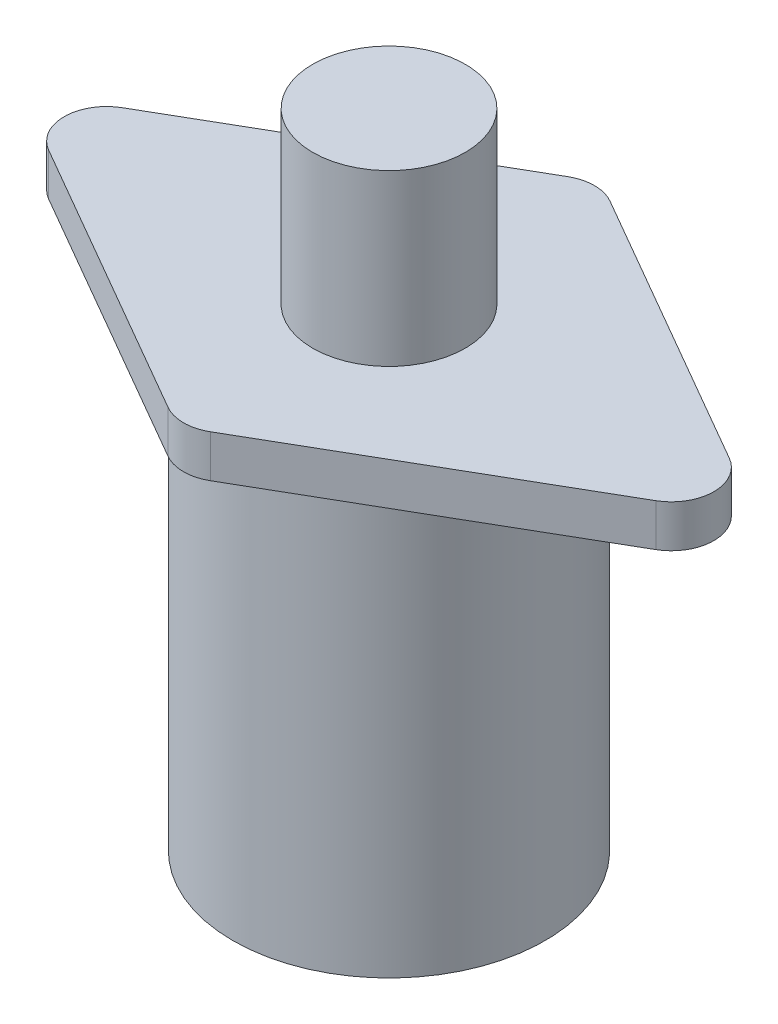
ISO-10303-21;
HEADER;
FILE_DESCRIPTION(('STEP AP214'),'2;1');
FILE_NAME('part.step','',(''),(''),'','','');
FILE_SCHEMA(('AUTOMOTIVE_DESIGN { 1 0 10303 214 1 1 1 1 }'));
ENDSEC;
DATA;
#1=APPLICATION_CONTEXT('core data for automotive mechanical design processes');
#2=APPLICATION_PROTOCOL_DEFINITION('international standard','automotive_design',2000,#1);
#3=PRODUCT_CONTEXT('',#1,'mechanical');
#4=PRODUCT('Part','Part','',(#3));
#5=PRODUCT_RELATED_PRODUCT_CATEGORY('part','',(#4));
#6=PRODUCT_DEFINITION_FORMATION('','',#4);
#7=PRODUCT_DEFINITION_CONTEXT('part definition',#1,'design');
#8=PRODUCT_DEFINITION('design','',#6,#7);
#9=PRODUCT_DEFINITION_SHAPE('','',#8);
#10=(LENGTH_UNIT() NAMED_UNIT(*) SI_UNIT(.MILLI.,.METRE.));
#11=(NAMED_UNIT(*) PLANE_ANGLE_UNIT() SI_UNIT($,.RADIAN.));
#12=(NAMED_UNIT(*) SI_UNIT($,.STERADIAN.) SOLID_ANGLE_UNIT());
#13=UNCERTAINTY_MEASURE_WITH_UNIT(LENGTH_MEASURE(1.E-05),#10,'distance_accuracy_value','');
#14=(GEOMETRIC_REPRESENTATION_CONTEXT(3) GLOBAL_UNCERTAINTY_ASSIGNED_CONTEXT((#13)) GLOBAL_UNIT_ASSIGNED_CONTEXT((#10,
#11,#12)) REPRESENTATION_CONTEXT('',''));
#15=CARTESIAN_POINT('',(0.,0.,0.));
#16=DIRECTION('',(0.,0.,1.));
#17=DIRECTION('',(1.,0.,0.));
#18=AXIS2_PLACEMENT_3D('',#15,#16,#17);
#19=CARTESIAN_POINT('',(0.,50.8,0.));
#20=DIRECTION('',(0.,-1.,0.));
#21=DIRECTION('',(0.,0.,-1.));
#22=AXIS2_PLACEMENT_3D('',#19,#20,#21);
#23=CYLINDRICAL_SURFACE('',#22,18.4);
#24=CARTESIAN_POINT('',(0.,50.8,0.));
#25=DIRECTION('',(0.,1.,0.));
#26=DIRECTION('',(0.,0.,1.));
#27=AXIS2_PLACEMENT_3D('',#24,#25,#26);
#28=CIRCLE('',#27,18.4);
#29=CARTESIAN_POINT('',(0.,50.8,18.4));
#30=VERTEX_POINT('',#29);
#31=EDGE_CURVE('E149',#30,#30,#28,.T.);
#32=ORIENTED_EDGE('',*,*,#31,.F.);
#33=EDGE_LOOP('',(#32));
#34=FACE_BOUND('',#33,.T.);
#35=CARTESIAN_POINT('',(0.,0.,0.));
#36=DIRECTION('',(0.,1.,0.));
#37=DIRECTION('',(0.,0.,1.));
#38=AXIS2_PLACEMENT_3D('',#35,#36,#37);
#39=CIRCLE('',#38,18.4);
#40=CARTESIAN_POINT('',(0.,0.,18.4));
#41=VERTEX_POINT('',#40);
#42=EDGE_CURVE('E152',#41,#41,#39,.T.);
#43=ORIENTED_EDGE('',*,*,#42,.T.);
#44=EDGE_LOOP('',(#43));
#45=FACE_BOUND('',#44,.T.);
#46=ADVANCED_FACE('F43',(#34,#45),#23,.T.);
#47=CARTESIAN_POINT('',(0.,0.,0.));
#48=DIRECTION('',(0.,1.,0.));
#49=DIRECTION('',(0.,0.,1.));
#50=AXIS2_PLACEMENT_3D('',#47,#48,#49);
#51=PLANE('',#50);
#52=ORIENTED_EDGE('',*,*,#42,.F.);
#53=EDGE_LOOP('',(#52));
#54=FACE_BOUND('',#53,.T.);
#55=ADVANCED_FACE('F222',(#54),#51,.F.);
#56=CARTESIAN_POINT('',(43.3012701892219,55.8,0.));
#57=DIRECTION('',(-0.5,0.,0.866025403784439));
#58=DIRECTION('',(0.866025403784439,0.,0.5));
#59=AXIS2_PLACEMENT_3D('',#56,#57,#58);
#60=PLANE('',#59);
#61=DIRECTION('',(-0.866025403784438,0.,-0.5));
#62=VECTOR('',#61,1.);
#63=CARTESIAN_POINT('',(43.3012701892219,50.8,0.));
#64=LINE('',#63,#62);
#65=CARTESIAN_POINT('',(35.8012701892219,50.8,-4.3301270189222));
#66=VERTEX_POINT('',#65);
#67=CARTESIAN_POINT('',(2.50000000000002,50.8,-23.5566243270259));
#68=VERTEX_POINT('',#67);
#69=EDGE_CURVE('E138',#66,#68,#64,.T.);
#70=ORIENTED_EDGE('',*,*,#69,.T.);
#71=DIRECTION('',(0.,-1.,0.));
#72=VECTOR('',#71,1.);
#73=CARTESIAN_POINT('',(2.50000000000002,55.8,-23.5566243270259));
#74=LINE('',#73,#72);
#75=CARTESIAN_POINT('',(2.50000000000002,55.8,-23.5566243270259));
#76=VERTEX_POINT('',#75);
#77=EDGE_CURVE('E116',#68,#76,#74,.F.);
#78=ORIENTED_EDGE('',*,*,#77,.T.);
#79=DIRECTION('',(-0.866025403784438,0.,-0.5));
#80=VECTOR('',#79,1.);
#81=CARTESIAN_POINT('',(43.3012701892219,55.8,0.));
#82=LINE('',#81,#80);
#83=CARTESIAN_POINT('',(35.8012701892219,55.8,-4.3301270189222));
#84=VERTEX_POINT('',#83);
#85=EDGE_CURVE('E148',#84,#76,#82,.T.);
#86=ORIENTED_EDGE('',*,*,#85,.F.);
#87=DIRECTION('',(0.,-1.,0.));
#88=VECTOR('',#87,1.);
#89=CARTESIAN_POINT('',(35.8012701892219,55.8,-4.3301270189222));
#90=LINE('',#89,#88);
#91=EDGE_CURVE('E121',#84,#66,#90,.T.);
#92=ORIENTED_EDGE('',*,*,#91,.T.);
#93=EDGE_LOOP('',(#70,#78,#86,#92));
#94=FACE_BOUND('',#93,.T.);
#95=ADVANCED_FACE('F197',(#94),#60,.F.);
#96=CARTESIAN_POINT('',(0.,55.8,-25.));
#97=DIRECTION('',(0.5,0.,0.866025403784439));
#98=DIRECTION('',(0.866025403784439,0.,-0.5));
#99=AXIS2_PLACEMENT_3D('',#96,#97,#98);
#100=PLANE('',#99);
#101=DIRECTION('',(-0.866025403784439,0.,0.5));
#102=VECTOR('',#101,1.);
#103=CARTESIAN_POINT('',(0.,55.8,-25.));
#104=LINE('',#103,#102);
#105=CARTESIAN_POINT('',(-2.49999999999999,55.8,-23.5566243270259));
#106=VERTEX_POINT('',#105);
#107=CARTESIAN_POINT('',(-35.8012701892219,55.8,-4.33012701892221));
#108=VERTEX_POINT('',#107);
#109=EDGE_CURVE('E131',#106,#108,#104,.T.);
#110=ORIENTED_EDGE('',*,*,#109,.F.);
#111=DIRECTION('',(0.,-1.,0.));
#112=VECTOR('',#111,1.);
#113=CARTESIAN_POINT('',(-2.49999999999999,55.8,-23.5566243270259));
#114=LINE('',#113,#112);
#115=CARTESIAN_POINT('',(-2.49999999999999,50.8,-23.5566243270259));
#116=VERTEX_POINT('',#115);
#117=EDGE_CURVE('E115',#106,#116,#114,.T.);
#118=ORIENTED_EDGE('',*,*,#117,.T.);
#119=DIRECTION('',(-0.866025403784439,0.,0.5));
#120=VECTOR('',#119,1.);
#121=CARTESIAN_POINT('',(0.,50.8,-25.));
#122=LINE('',#121,#120);
#123=CARTESIAN_POINT('',(-35.8012701892219,50.8,-4.33012701892221));
#124=VERTEX_POINT('',#123);
#125=EDGE_CURVE('E128',#116,#124,#122,.T.);
#126=ORIENTED_EDGE('',*,*,#125,.T.);
#127=DIRECTION('',(0.,-1.,0.));
#128=VECTOR('',#127,1.);
#129=CARTESIAN_POINT('',(-35.8012701892219,55.8,-4.3301270189222));
#130=LINE('',#129,#128);
#131=EDGE_CURVE('E133',#124,#108,#130,.F.);
#132=ORIENTED_EDGE('',*,*,#131,.T.);
#133=EDGE_LOOP('',(#110,#118,#126,#132));
#134=FACE_BOUND('',#133,.T.);
#135=ADVANCED_FACE('F127',(#134),#100,.F.);
#136=CARTESIAN_POINT('',(-43.3012701892219,55.8,0.));
#137=DIRECTION('',(0.5,0.,-0.866025403784439));
#138=DIRECTION('',(-0.866025403784439,0.,-0.5));
#139=AXIS2_PLACEMENT_3D('',#136,#137,#138);
#140=PLANE('',#139);
#141=DIRECTION('',(0.866025403784439,0.,0.5));
#142=VECTOR('',#141,1.);
#143=CARTESIAN_POINT('',(-43.3012701892219,50.8,0.));
#144=LINE('',#143,#142);
#145=CARTESIAN_POINT('',(-35.8012701892219,50.8,4.33012701892218));
#146=VERTEX_POINT('',#145);
#147=CARTESIAN_POINT('',(-2.5,50.8,23.5566243270259));
#148=VERTEX_POINT('',#147);
#149=EDGE_CURVE('E137',#146,#148,#144,.T.);
#150=ORIENTED_EDGE('',*,*,#149,.T.);
#151=DIRECTION('',(0.,-1.,0.));
#152=VECTOR('',#151,1.);
#153=CARTESIAN_POINT('',(-2.5,55.8,23.5566243270259));
#154=LINE('',#153,#152);
#155=CARTESIAN_POINT('',(-2.5,55.8,23.5566243270259));
#156=VERTEX_POINT('',#155);
#157=EDGE_CURVE('E47',#148,#156,#154,.F.);
#158=ORIENTED_EDGE('',*,*,#157,.T.);
#159=DIRECTION('',(0.866025403784439,0.,0.5));
#160=VECTOR('',#159,1.);
#161=CARTESIAN_POINT('',(-43.3012701892219,55.8,0.));
#162=LINE('',#161,#160);
#163=CARTESIAN_POINT('',(-35.8012701892219,55.8,4.33012701892218));
#164=VERTEX_POINT('',#163);
#165=EDGE_CURVE('E181',#164,#156,#162,.T.);
#166=ORIENTED_EDGE('',*,*,#165,.F.);
#167=DIRECTION('',(0.,-1.,0.));
#168=VECTOR('',#167,1.);
#169=CARTESIAN_POINT('',(-35.8012701892219,55.8,4.33012701892218));
#170=LINE('',#169,#168);
#171=EDGE_CURVE('E174',#164,#146,#170,.T.);
#172=ORIENTED_EDGE('',*,*,#171,.T.);
#173=EDGE_LOOP('',(#150,#158,#166,#172));
#174=FACE_BOUND('',#173,.T.);
#175=ADVANCED_FACE('F180',(#174),#140,.F.);
#176=CARTESIAN_POINT('',(0.,55.8,25.));
#177=DIRECTION('',(-0.5,0.,-0.866025403784439));
#178=DIRECTION('',(-0.866025403784439,0.,0.5));
#179=AXIS2_PLACEMENT_3D('',#176,#177,#178);
#180=PLANE('',#179);
#181=DIRECTION('',(0.866025403784439,0.,-0.5));
#182=VECTOR('',#181,1.);
#183=CARTESIAN_POINT('',(0.,55.8,25.));
#184=LINE('',#183,#182);
#185=CARTESIAN_POINT('',(2.50000000000001,55.8,23.5566243270259));
#186=VERTEX_POINT('',#185);
#187=CARTESIAN_POINT('',(35.8012701892219,55.8,4.33012701892219));
#188=VERTEX_POINT('',#187);
#189=EDGE_CURVE('E155',#186,#188,#184,.T.);
#190=ORIENTED_EDGE('',*,*,#189,.F.);
#191=DIRECTION('',(0.,-1.,0.));
#192=VECTOR('',#191,1.);
#193=CARTESIAN_POINT('',(2.50000000000001,55.8,23.5566243270259));
#194=LINE('',#193,#192);
#195=CARTESIAN_POINT('',(2.50000000000001,50.8,23.5566243270259));
#196=VERTEX_POINT('',#195);
#197=EDGE_CURVE('E172',#186,#196,#194,.T.);
#198=ORIENTED_EDGE('',*,*,#197,.T.);
#199=DIRECTION('',(0.866025403784439,0.,-0.5));
#200=VECTOR('',#199,1.);
#201=CARTESIAN_POINT('',(0.,50.8,25.));
#202=LINE('',#201,#200);
#203=CARTESIAN_POINT('',(35.8012701892219,50.8,4.33012701892219));
#204=VERTEX_POINT('',#203);
#205=EDGE_CURVE('E141',#196,#204,#202,.T.);
#206=ORIENTED_EDGE('',*,*,#205,.T.);
#207=DIRECTION('',(0.,-1.,0.));
#208=VECTOR('',#207,1.);
#209=CARTESIAN_POINT('',(35.8012701892219,55.8,4.33012701892219));
#210=LINE('',#209,#208);
#211=EDGE_CURVE('E59',#204,#188,#210,.F.);
#212=ORIENTED_EDGE('',*,*,#211,.T.);
#213=EDGE_LOOP('',(#190,#198,#206,#212));
#214=FACE_BOUND('',#213,.T.);
#215=ADVANCED_FACE('F190',(#214),#180,.F.);
#216=CARTESIAN_POINT('',(0.,55.8,0.));
#217=DIRECTION('',(0.,1.,0.));
#218=DIRECTION('',(0.,0.,1.));
#219=AXIS2_PLACEMENT_3D('',#216,#217,#218);
#220=PLANE('',#219);
#221=CARTESIAN_POINT('',(0.,55.8,0.));
#222=DIRECTION('',(0.,1.,0.));
#223=DIRECTION('',(0.,0.,1.));
#224=AXIS2_PLACEMENT_3D('',#221,#222,#223);
#225=CIRCLE('',#224,9.);
#226=CARTESIAN_POINT('',(0.,55.8,9.));
#227=VERTEX_POINT('',#226);
#228=EDGE_CURVE('E11',#227,#227,#225,.T.);
#229=ORIENTED_EDGE('',*,*,#228,.F.);
#230=EDGE_LOOP('',(#229));
#231=FACE_BOUND('',#230,.T.);
#232=ORIENTED_EDGE('',*,*,#85,.T.);
#233=CARTESIAN_POINT('',(0.,55.8,-19.2264973081038));
#234=DIRECTION('',(0.,1.,0.));
#235=DIRECTION('',(0.,0.,1.));
#236=AXIS2_PLACEMENT_3D('',#233,#234,#235);
#237=CIRCLE('',#236,5.);
#238=EDGE_CURVE('E169',#76,#106,#237,.T.);
#239=ORIENTED_EDGE('',*,*,#238,.T.);
#240=ORIENTED_EDGE('',*,*,#109,.T.);
#241=CARTESIAN_POINT('',(-33.3012701892219,55.8,0.));
#242=DIRECTION('',(0.,1.,0.));
#243=DIRECTION('',(0.,0.,1.));
#244=AXIS2_PLACEMENT_3D('',#241,#242,#243);
#245=CIRCLE('',#244,5.);
#246=EDGE_CURVE('E164',#108,#164,#245,.T.);
#247=ORIENTED_EDGE('',*,*,#246,.T.);
#248=ORIENTED_EDGE('',*,*,#165,.T.);
#249=CARTESIAN_POINT('',(0.,55.8,19.2264973081037));
#250=DIRECTION('',(0.,1.,0.));
#251=DIRECTION('',(0.,0.,1.));
#252=AXIS2_PLACEMENT_3D('',#249,#250,#251);
#253=CIRCLE('',#252,5.);
#254=EDGE_CURVE('E66',#156,#186,#253,.T.);
#255=ORIENTED_EDGE('',*,*,#254,.T.);
#256=ORIENTED_EDGE('',*,*,#189,.T.);
#257=CARTESIAN_POINT('',(33.3012701892219,55.8,0.));
#258=DIRECTION('',(0.,1.,0.));
#259=DIRECTION('',(0.,0.,1.));
#260=AXIS2_PLACEMENT_3D('',#257,#258,#259);
#261=CIRCLE('',#260,5.);
#262=EDGE_CURVE('E166',#188,#84,#261,.T.);
#263=ORIENTED_EDGE('',*,*,#262,.T.);
#264=EDGE_LOOP('',(#232,#239,#240,#247,#248,#255,#256,#263));
#265=FACE_BOUND('',#264,.T.);
#266=ADVANCED_FACE('F184',(#231,#265),#220,.T.);
#267=CARTESIAN_POINT('',(0.,50.8,0.));
#268=DIRECTION('',(0.,1.,0.));
#269=DIRECTION('',(0.,0.,1.));
#270=AXIS2_PLACEMENT_3D('',#267,#268,#269);
#271=PLANE('',#270);
#272=ORIENTED_EDGE('',*,*,#31,.T.);
#273=EDGE_LOOP('',(#272));
#274=FACE_BOUND('',#273,.T.);
#275=ORIENTED_EDGE('',*,*,#125,.F.);
#276=CARTESIAN_POINT('',(0.,50.8,-19.2264973081038));
#277=DIRECTION('',(0.,1.,0.));
#278=DIRECTION('',(0.,0.,1.));
#279=AXIS2_PLACEMENT_3D('',#276,#277,#278);
#280=CIRCLE('',#279,5.);
#281=EDGE_CURVE('E111',#116,#68,#280,.F.);
#282=ORIENTED_EDGE('',*,*,#281,.T.);
#283=ORIENTED_EDGE('',*,*,#69,.F.);
#284=CARTESIAN_POINT('',(33.3012701892219,50.8,0.));
#285=DIRECTION('',(0.,1.,0.));
#286=DIRECTION('',(0.,0.,1.));
#287=AXIS2_PLACEMENT_3D('',#284,#285,#286);
#288=CIRCLE('',#287,5.);
#289=EDGE_CURVE('E158',#66,#204,#288,.F.);
#290=ORIENTED_EDGE('',*,*,#289,.T.);
#291=ORIENTED_EDGE('',*,*,#205,.F.);
#292=CARTESIAN_POINT('',(0.,50.8,19.2264973081037));
#293=DIRECTION('',(0.,1.,0.));
#294=DIRECTION('',(0.,0.,1.));
#295=AXIS2_PLACEMENT_3D('',#292,#293,#294);
#296=CIRCLE('',#295,5.);
#297=EDGE_CURVE('E122',#196,#148,#296,.F.);
#298=ORIENTED_EDGE('',*,*,#297,.T.);
#299=ORIENTED_EDGE('',*,*,#149,.F.);
#300=CARTESIAN_POINT('',(-33.3012701892219,50.8,0.));
#301=DIRECTION('',(0.,1.,0.));
#302=DIRECTION('',(0.,0.,1.));
#303=AXIS2_PLACEMENT_3D('',#300,#301,#302);
#304=CIRCLE('',#303,5.);
#305=EDGE_CURVE('E132',#146,#124,#304,.F.);
#306=ORIENTED_EDGE('',*,*,#305,.T.);
#307=EDGE_LOOP('',(#275,#282,#283,#290,#291,#298,#299,#306));
#308=FACE_BOUND('',#307,.T.);
#309=ADVANCED_FACE('F135',(#274,#308),#271,.F.);
#310=CARTESIAN_POINT('',(0.,55.8,-19.2264973081038));
#311=DIRECTION('',(0.,-1.,0.));
#312=DIRECTION('',(0.,0.,-1.));
#313=AXIS2_PLACEMENT_3D('',#310,#311,#312);
#314=CYLINDRICAL_SURFACE('',#313,5.);
#315=ORIENTED_EDGE('',*,*,#238,.F.);
#316=ORIENTED_EDGE('',*,*,#77,.F.);
#317=ORIENTED_EDGE('',*,*,#281,.F.);
#318=ORIENTED_EDGE('',*,*,#117,.F.);
#319=EDGE_LOOP('',(#315,#316,#317,#318));
#320=FACE_BOUND('',#319,.T.);
#321=ADVANCED_FACE('F114',(#320),#314,.T.);
#322=CARTESIAN_POINT('',(0.,55.8,19.2264973081037));
#323=DIRECTION('',(0.,-1.,0.));
#324=DIRECTION('',(0.,0.,-1.));
#325=AXIS2_PLACEMENT_3D('',#322,#323,#324);
#326=CYLINDRICAL_SURFACE('',#325,5.);
#327=ORIENTED_EDGE('',*,*,#254,.F.);
#328=ORIENTED_EDGE('',*,*,#157,.F.);
#329=ORIENTED_EDGE('',*,*,#297,.F.);
#330=ORIENTED_EDGE('',*,*,#197,.F.);
#331=EDGE_LOOP('',(#327,#328,#329,#330));
#332=FACE_BOUND('',#331,.T.);
#333=ADVANCED_FACE('F188',(#332),#326,.T.);
#334=CARTESIAN_POINT('',(33.3012701892219,55.8,0.));
#335=DIRECTION('',(0.,-1.,0.));
#336=DIRECTION('',(0.,0.,-1.));
#337=AXIS2_PLACEMENT_3D('',#334,#335,#336);
#338=CYLINDRICAL_SURFACE('',#337,5.);
#339=ORIENTED_EDGE('',*,*,#262,.F.);
#340=ORIENTED_EDGE('',*,*,#211,.F.);
#341=ORIENTED_EDGE('',*,*,#289,.F.);
#342=ORIENTED_EDGE('',*,*,#91,.F.);
#343=EDGE_LOOP('',(#339,#340,#341,#342));
#344=FACE_BOUND('',#343,.T.);
#345=ADVANCED_FACE('F194',(#344),#338,.T.);
#346=CARTESIAN_POINT('',(-33.3012701892219,55.8,0.));
#347=DIRECTION('',(0.,-1.,0.));
#348=DIRECTION('',(0.,0.,-1.));
#349=AXIS2_PLACEMENT_3D('',#346,#347,#348);
#350=CYLINDRICAL_SURFACE('',#349,5.);
#351=ORIENTED_EDGE('',*,*,#246,.F.);
#352=ORIENTED_EDGE('',*,*,#131,.F.);
#353=ORIENTED_EDGE('',*,*,#305,.F.);
#354=ORIENTED_EDGE('',*,*,#171,.F.);
#355=EDGE_LOOP('',(#351,#352,#353,#354));
#356=FACE_BOUND('',#355,.T.);
#357=ADVANCED_FACE('F45',(#356),#350,.T.);
#358=CARTESIAN_POINT('',(0.,75.8,0.));
#359=DIRECTION('',(0.,-1.,0.));
#360=DIRECTION('',(0.,0.,-1.));
#361=AXIS2_PLACEMENT_3D('',#358,#359,#360);
#362=CYLINDRICAL_SURFACE('',#361,9.);
#363=CARTESIAN_POINT('',(0.,75.8,0.));
#364=DIRECTION('',(0.,1.,0.));
#365=DIRECTION('',(0.,0.,1.));
#366=AXIS2_PLACEMENT_3D('',#363,#364,#365);
#367=CIRCLE('',#366,9.);
#368=CARTESIAN_POINT('',(0.,75.8,9.));
#369=VERTEX_POINT('',#368);
#370=EDGE_CURVE('E143',#369,#369,#367,.T.);
#371=ORIENTED_EDGE('',*,*,#370,.F.);
#372=EDGE_LOOP('',(#371));
#373=FACE_BOUND('',#372,.T.);
#374=ORIENTED_EDGE('',*,*,#228,.T.);
#375=EDGE_LOOP('',(#374));
#376=FACE_BOUND('',#375,.T.);
#377=ADVANCED_FACE('F206',(#373,#376),#362,.T.);
#378=CARTESIAN_POINT('',(0.,75.8,0.));
#379=DIRECTION('',(0.,1.,0.));
#380=DIRECTION('',(0.,0.,1.));
#381=AXIS2_PLACEMENT_3D('',#378,#379,#380);
#382=PLANE('',#381);
#383=ORIENTED_EDGE('',*,*,#370,.T.);
#384=EDGE_LOOP('',(#383));
#385=FACE_BOUND('',#384,.T.);
#386=ADVANCED_FACE('F204',(#385),#382,.T.);
#387=CLOSED_SHELL('',(#46,#55,#95,#135,#175,#215,#266,#309,#321,#333,#345,#357,#377,#386));
#388=MANIFOLD_SOLID_BREP('B2',#387);
#389=ADVANCED_BREP_SHAPE_REPRESENTATION('',(#18,#388),#14);
#390=SHAPE_DEFINITION_REPRESENTATION(#9,#389);
ENDSEC;
END-ISO-10303-21;
